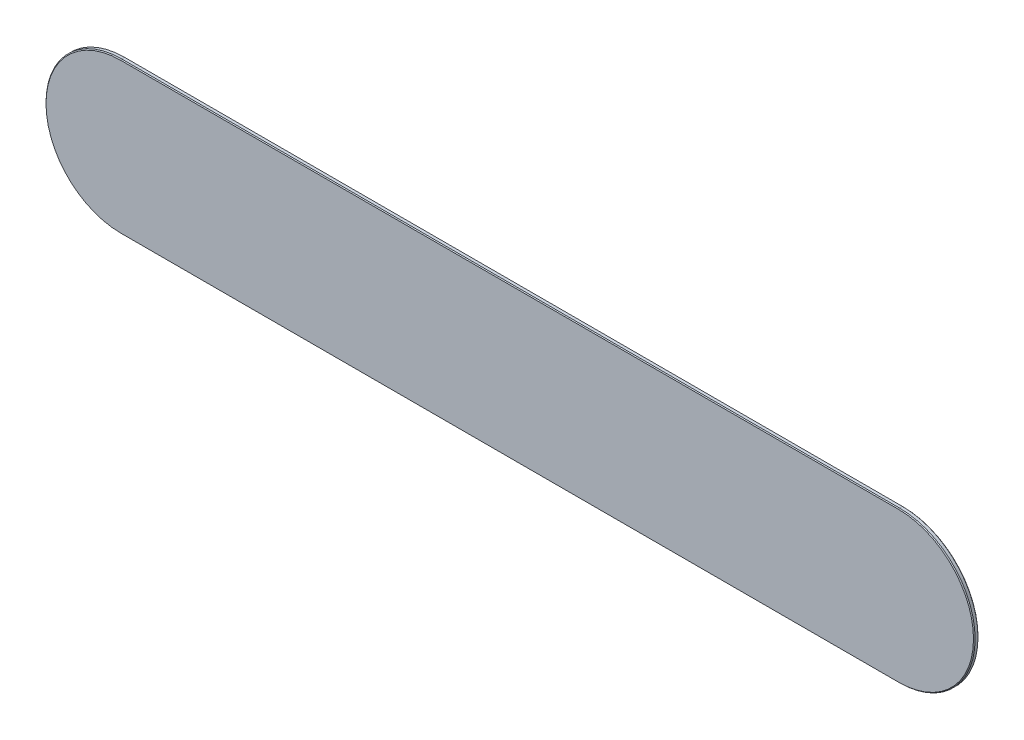
ISO-10303-21;
HEADER;
FILE_DESCRIPTION(('STEP AP214'),'2;1');
FILE_NAME('part.step','',(''),(''),'','','');
FILE_SCHEMA(('AUTOMOTIVE_DESIGN { 1 0 10303 214 1 1 1 1 }'));
ENDSEC;
DATA;
#1=APPLICATION_CONTEXT('core data for automotive mechanical design processes');
#2=APPLICATION_PROTOCOL_DEFINITION('international standard','automotive_design',2000,#1);
#3=PRODUCT_CONTEXT('',#1,'mechanical');
#4=PRODUCT('Part','Part','',(#3));
#5=PRODUCT_RELATED_PRODUCT_CATEGORY('part','',(#4));
#6=PRODUCT_DEFINITION_FORMATION('','',#4);
#7=PRODUCT_DEFINITION_CONTEXT('part definition',#1,'design');
#8=PRODUCT_DEFINITION('design','',#6,#7);
#9=PRODUCT_DEFINITION_SHAPE('','',#8);
#10=(LENGTH_UNIT() NAMED_UNIT(*) SI_UNIT(.MILLI.,.METRE.));
#11=(NAMED_UNIT(*) PLANE_ANGLE_UNIT() SI_UNIT($,.RADIAN.));
#12=(NAMED_UNIT(*) SI_UNIT($,.STERADIAN.) SOLID_ANGLE_UNIT());
#13=UNCERTAINTY_MEASURE_WITH_UNIT(LENGTH_MEASURE(1.E-05),#10,'distance_accuracy_value','');
#14=(GEOMETRIC_REPRESENTATION_CONTEXT(3) GLOBAL_UNCERTAINTY_ASSIGNED_CONTEXT((#13)) GLOBAL_UNIT_ASSIGNED_CONTEXT((#10,
#11,#12)) REPRESENTATION_CONTEXT('',''));
#15=CARTESIAN_POINT('',(0.,0.,0.));
#16=DIRECTION('',(0.,0.,1.));
#17=DIRECTION('',(1.,0.,0.));
#18=AXIS2_PLACEMENT_3D('',#15,#16,#17);
#19=CARTESIAN_POINT('',(0.,-9.19,-0.6));
#20=DIRECTION('',(0.,-0.707106781186548,-0.707106781186548));
#21=DIRECTION('',(0.,-0.707106781186548,0.707106781186548));
#22=AXIS2_PLACEMENT_3D('',#19,#20,#21);
#23=PLANE('',#22);
#24=DIRECTION('',(-2.45688067934799E-11,-0.707106781186498,0.707106781186598));
#25=VECTOR('',#24,1.);
#26=CARTESIAN_POINT('',(47.5,-9.14,-0.65));
#27=LINE('',#26,#25);
#28=CARTESIAN_POINT('',(47.5,-9.14,-0.65));
#29=VERTEX_POINT('',#28);
#30=CARTESIAN_POINT('',(47.49999999999,-9.24,-0.55));
#31=VERTEX_POINT('',#30);
#32=EDGE_CURVE('E128',#29,#31,#27,.T.);
#33=ORIENTED_EDGE('',*,*,#32,.T.);
#34=DIRECTION('',(1.,0.,0.));
#35=VECTOR('',#34,1.);
#36=CARTESIAN_POINT('',(-47.49999999999,-9.24,-0.55));
#37=LINE('',#36,#35);
#38=CARTESIAN_POINT('',(-47.49999999999,-9.24,-0.55));
#39=VERTEX_POINT('',#38);
#40=EDGE_CURVE('E125',#39,#31,#37,.T.);
#41=ORIENTED_EDGE('',*,*,#40,.F.);
#42=DIRECTION('',(-2.49205075042299E-11,0.707106781186498,-0.707106781186598));
#43=VECTOR('',#42,1.);
#44=CARTESIAN_POINT('',(-47.49999999999,-9.24,-0.55));
#45=LINE('',#44,#43);
#46=CARTESIAN_POINT('',(-47.5,-9.14,-0.65));
#47=VERTEX_POINT('',#46);
#48=EDGE_CURVE('E11',#39,#47,#45,.T.);
#49=ORIENTED_EDGE('',*,*,#48,.T.);
#50=DIRECTION('',(1.,0.,0.));
#51=VECTOR('',#50,1.);
#52=CARTESIAN_POINT('',(-47.5,-9.14,-0.65));
#53=LINE('',#52,#51);
#54=EDGE_CURVE('E174',#47,#29,#53,.T.);
#55=ORIENTED_EDGE('',*,*,#54,.T.);
#56=EDGE_LOOP('',(#33,#41,#49,#55));
#57=FACE_BOUND('',#56,.T.);
#58=ADVANCED_FACE('F17',(#57),#23,.T.);
#59=CARTESIAN_POINT('',(-47.5,0.,-0.6));
#60=DIRECTION('',(0.,0.,1.));
#61=DIRECTION('',(0.,-1.,0.));
#62=AXIS2_PLACEMENT_3D('',#59,#60,#61);
#63=CONICAL_SURFACE('',#62,9.19,0.7853981633973);
#64=ORIENTED_EDGE('',*,*,#48,.F.);
#65=CARTESIAN_POINT('',(-47.5,0.,-0.55));
#66=DIRECTION('',(0.,0.,1.));
#67=DIRECTION('',(-1.,0.,0.));
#68=AXIS2_PLACEMENT_3D('',#65,#66,#67);
#69=CIRCLE('',#68,9.24);
#70=CARTESIAN_POINT('',(-56.74,0.,-0.55));
#71=VERTEX_POINT('',#70);
#72=EDGE_CURVE('E114',#71,#39,#69,.T.);
#73=ORIENTED_EDGE('',*,*,#72,.F.);
#74=CARTESIAN_POINT('',(-47.5,0.,-0.55));
#75=DIRECTION('',(0.,0.,1.));
#76=DIRECTION('',(1.08196280218E-12,1.,0.));
#77=AXIS2_PLACEMENT_3D('',#74,#75,#76);
#78=CIRCLE('',#77,9.24);
#79=CARTESIAN_POINT('',(-47.49999999999,9.24,-0.55));
#80=VERTEX_POINT('',#79);
#81=EDGE_CURVE('E144',#80,#71,#78,.T.);
#82=ORIENTED_EDGE('',*,*,#81,.F.);
#83=DIRECTION('',(1.778600737197E-11,0.707106781186598,0.707106781186498));
#84=VECTOR('',#83,1.);
#85=CARTESIAN_POINT('',(-47.49999999999,9.14,-0.65));
#86=LINE('',#85,#84);
#87=CARTESIAN_POINT('',(-47.49999999999,9.14,-0.65));
#88=VERTEX_POINT('',#87);
#89=EDGE_CURVE('E28',#88,#80,#86,.T.);
#90=ORIENTED_EDGE('',*,*,#89,.F.);
#91=CARTESIAN_POINT('',(-47.5,0.,-0.65));
#92=DIRECTION('',(0.,0.,1.));
#93=DIRECTION('',(0.,1.,0.));
#94=AXIS2_PLACEMENT_3D('',#91,#92,#93);
#95=CIRCLE('',#94,9.14);
#96=EDGE_CURVE('E121',#88,#47,#95,.T.);
#97=ORIENTED_EDGE('',*,*,#96,.T.);
#98=EDGE_LOOP('',(#64,#73,#82,#90,#97));
#99=FACE_BOUND('',#98,.T.);
#100=ADVANCED_FACE('F119',(#99),#63,.T.);
#101=CARTESIAN_POINT('',(0.,9.19,-0.6));
#102=DIRECTION('',(0.,0.707106781186598,-0.707106781186498));
#103=DIRECTION('',(-1.,0.,0.));
#104=AXIS2_PLACEMENT_3D('',#101,#102,#103);
#105=PLANE('',#104);
#106=ORIENTED_EDGE('',*,*,#89,.T.);
#107=DIRECTION('',(-1.,0.,0.));
#108=VECTOR('',#107,1.);
#109=CARTESIAN_POINT('',(47.49999999999,9.24,-0.55));
#110=LINE('',#109,#108);
#111=CARTESIAN_POINT('',(47.49999999999,9.24,-0.55));
#112=VERTEX_POINT('',#111);
#113=EDGE_CURVE('E157',#112,#80,#110,.T.);
#114=ORIENTED_EDGE('',*,*,#113,.F.);
#115=DIRECTION('',(1.84391658347799E-11,-0.707106781186498,-0.707106781186598));
#116=VECTOR('',#115,1.);
#117=CARTESIAN_POINT('',(47.49999999999,9.24,-0.55));
#118=LINE('',#117,#116);
#119=CARTESIAN_POINT('',(47.5,9.14,-0.65));
#120=VERTEX_POINT('',#119);
#121=EDGE_CURVE('E175',#112,#120,#118,.T.);
#122=ORIENTED_EDGE('',*,*,#121,.T.);
#123=DIRECTION('',(-1.,0.,0.));
#124=VECTOR('',#123,1.);
#125=CARTESIAN_POINT('',(47.49999999999,9.14,-0.65));
#126=LINE('',#125,#124);
#127=EDGE_CURVE('E186',#120,#88,#126,.T.);
#128=ORIENTED_EDGE('',*,*,#127,.T.);
#129=EDGE_LOOP('',(#106,#114,#122,#128));
#130=FACE_BOUND('',#129,.T.);
#131=ADVANCED_FACE('F241',(#130),#105,.T.);
#132=CARTESIAN_POINT('',(0.,0.,-0.65));
#133=DIRECTION('',(0.,0.,1.));
#134=DIRECTION('',(1.,0.,0.));
#135=AXIS2_PLACEMENT_3D('',#132,#133,#134);
#136=PLANE('',#135);
#137=ORIENTED_EDGE('',*,*,#54,.F.);
#138=ORIENTED_EDGE('',*,*,#96,.F.);
#139=ORIENTED_EDGE('',*,*,#127,.F.);
#140=CARTESIAN_POINT('',(47.5,0.,-0.65));
#141=DIRECTION('',(0.,0.,1.));
#142=DIRECTION('',(0.,-1.,0.));
#143=AXIS2_PLACEMENT_3D('',#140,#141,#142);
#144=CIRCLE('',#143,9.14);
#145=EDGE_CURVE('E170',#29,#120,#144,.T.);
#146=ORIENTED_EDGE('',*,*,#145,.F.);
#147=EDGE_LOOP('',(#137,#138,#139,#146));
#148=FACE_BOUND('',#147,.T.);
#149=ADVANCED_FACE('F19',(#148),#136,.F.);
#150=CARTESIAN_POINT('',(47.5,0.,-0.6));
#151=DIRECTION('',(0.,0.,1.));
#152=DIRECTION('',(0.,-1.,0.));
#153=AXIS2_PLACEMENT_3D('',#150,#151,#152);
#154=CONICAL_SURFACE('',#153,9.19,0.7853981633973);
#155=ORIENTED_EDGE('',*,*,#121,.F.);
#156=CARTESIAN_POINT('',(47.5,0.,-0.55));
#157=DIRECTION('',(0.,0.,1.));
#158=DIRECTION('',(1.,0.,0.));
#159=AXIS2_PLACEMENT_3D('',#156,#157,#158);
#160=CIRCLE('',#159,9.24);
#161=CARTESIAN_POINT('',(56.74,0.,-0.55));
#162=VERTEX_POINT('',#161);
#163=EDGE_CURVE('E179',#162,#112,#160,.T.);
#164=ORIENTED_EDGE('',*,*,#163,.F.);
#165=CARTESIAN_POINT('',(47.5,0.,-0.55));
#166=DIRECTION('',(0.,0.,1.));
#167=DIRECTION('',(-1.08196280218E-12,-1.,0.));
#168=AXIS2_PLACEMENT_3D('',#165,#166,#167);
#169=CIRCLE('',#168,9.24);
#170=EDGE_CURVE('E223',#31,#162,#169,.T.);
#171=ORIENTED_EDGE('',*,*,#170,.F.);
#172=ORIENTED_EDGE('',*,*,#32,.F.);
#173=ORIENTED_EDGE('',*,*,#145,.T.);
#174=EDGE_LOOP('',(#155,#164,#171,#172,#173));
#175=FACE_BOUND('',#174,.T.);
#176=ADVANCED_FACE('F300',(#175),#154,.T.);
#177=CARTESIAN_POINT('',(47.5,0.,-0.1));
#178=DIRECTION('',(0.,0.,1.));
#179=DIRECTION('',(1.,0.,0.));
#180=AXIS2_PLACEMENT_3D('',#177,#178,#179);
#181=CYLINDRICAL_SURFACE('',#180,9.24);
#182=DIRECTION('',(0.,0.,1.));
#183=VECTOR('',#182,1.);
#184=CARTESIAN_POINT('',(47.49999999999,-9.24,-0.55));
#185=LINE('',#184,#183);
#186=CARTESIAN_POINT('',(47.49999999999,-9.24,-0.2));
#187=VERTEX_POINT('',#186);
#188=EDGE_CURVE('E132',#31,#187,#185,.T.);
#189=ORIENTED_EDGE('',*,*,#188,.F.);
#190=ORIENTED_EDGE('',*,*,#170,.T.);
#191=ORIENTED_EDGE('',*,*,#163,.T.);
#192=DIRECTION('',(0.,0.,-1.));
#193=VECTOR('',#192,1.);
#194=CARTESIAN_POINT('',(47.49999999999,9.24,-0.2));
#195=LINE('',#194,#193);
#196=CARTESIAN_POINT('',(47.49999999999,9.24,-0.2));
#197=VERTEX_POINT('',#196);
#198=EDGE_CURVE('E184',#197,#112,#195,.T.);
#199=ORIENTED_EDGE('',*,*,#198,.F.);
#200=CARTESIAN_POINT('',(47.5,0.,-0.2));
#201=DIRECTION('',(0.,0.,-1.));
#202=DIRECTION('',(-1.08196280218E-12,1.,0.));
#203=AXIS2_PLACEMENT_3D('',#200,#201,#202);
#204=CIRCLE('',#203,9.24);
#205=CARTESIAN_POINT('',(56.74,0.,-0.2));
#206=VERTEX_POINT('',#205);
#207=EDGE_CURVE('E197',#197,#206,#204,.T.);
#208=ORIENTED_EDGE('',*,*,#207,.T.);
#209=CARTESIAN_POINT('',(47.5,0.,-0.2));
#210=DIRECTION('',(0.,0.,-1.));
#211=DIRECTION('',(1.,0.,0.));
#212=AXIS2_PLACEMENT_3D('',#209,#210,#211);
#213=CIRCLE('',#212,9.24);
#214=EDGE_CURVE('E200',#206,#187,#213,.T.);
#215=ORIENTED_EDGE('',*,*,#214,.T.);
#216=EDGE_LOOP('',(#189,#190,#191,#199,#208,#215));
#217=FACE_BOUND('',#216,.T.);
#218=ADVANCED_FACE('F238',(#217),#181,.T.);
#219=CARTESIAN_POINT('',(-47.5,-9.24,-0.1));
#220=DIRECTION('',(0.,-1.,0.));
#221=DIRECTION('',(0.,0.,-1.));
#222=AXIS2_PLACEMENT_3D('',#219,#220,#221);
#223=PLANE('',#222);
#224=DIRECTION('',(0.,0.,-1.));
#225=VECTOR('',#224,1.);
#226=CARTESIAN_POINT('',(-47.49999999999,-9.24,-0.2));
#227=LINE('',#226,#225);
#228=CARTESIAN_POINT('',(-47.49999999999,-9.24,-0.2));
#229=VERTEX_POINT('',#228);
#230=EDGE_CURVE('E133',#229,#39,#227,.T.);
#231=ORIENTED_EDGE('',*,*,#230,.T.);
#232=ORIENTED_EDGE('',*,*,#40,.T.);
#233=ORIENTED_EDGE('',*,*,#188,.T.);
#234=DIRECTION('',(-1.,0.,0.));
#235=VECTOR('',#234,1.);
#236=CARTESIAN_POINT('',(47.49999999999,-9.24,-0.2));
#237=LINE('',#236,#235);
#238=EDGE_CURVE('E138',#187,#229,#237,.T.);
#239=ORIENTED_EDGE('',*,*,#238,.T.);
#240=EDGE_LOOP('',(#231,#232,#233,#239));
#241=FACE_BOUND('',#240,.T.);
#242=ADVANCED_FACE('F136',(#241),#223,.T.);
#243=CARTESIAN_POINT('',(-47.5,0.,-0.1));
#244=DIRECTION('',(0.,0.,1.));
#245=DIRECTION('',(1.,0.,0.));
#246=AXIS2_PLACEMENT_3D('',#243,#244,#245);
#247=CYLINDRICAL_SURFACE('',#246,9.24);
#248=DIRECTION('',(0.,0.,1.));
#249=VECTOR('',#248,1.);
#250=CARTESIAN_POINT('',(-47.49999999999,9.24,-0.55));
#251=LINE('',#250,#249);
#252=CARTESIAN_POINT('',(-47.49999999999,9.24,-0.2));
#253=VERTEX_POINT('',#252);
#254=EDGE_CURVE('E151',#80,#253,#251,.T.);
#255=ORIENTED_EDGE('',*,*,#254,.F.);
#256=ORIENTED_EDGE('',*,*,#81,.T.);
#257=ORIENTED_EDGE('',*,*,#72,.T.);
#258=ORIENTED_EDGE('',*,*,#230,.F.);
#259=CARTESIAN_POINT('',(-47.5,0.,-0.2));
#260=DIRECTION('',(0.,0.,-1.));
#261=DIRECTION('',(1.080424830891E-12,-1.,0.));
#262=AXIS2_PLACEMENT_3D('',#259,#260,#261);
#263=CIRCLE('',#262,9.24);
#264=CARTESIAN_POINT('',(-56.74,0.,-0.2));
#265=VERTEX_POINT('',#264);
#266=EDGE_CURVE('E169',#229,#265,#263,.T.);
#267=ORIENTED_EDGE('',*,*,#266,.T.);
#268=CARTESIAN_POINT('',(-47.5,0.,-0.2));
#269=DIRECTION('',(0.,0.,-1.));
#270=DIRECTION('',(-1.,0.,0.));
#271=AXIS2_PLACEMENT_3D('',#268,#269,#270);
#272=CIRCLE('',#271,9.24);
#273=EDGE_CURVE('E161',#265,#253,#272,.T.);
#274=ORIENTED_EDGE('',*,*,#273,.T.);
#275=EDGE_LOOP('',(#255,#256,#257,#258,#267,#274));
#276=FACE_BOUND('',#275,.T.);
#277=ADVANCED_FACE('F143',(#276),#247,.T.);
#278=CARTESIAN_POINT('',(47.5,9.24,-0.1));
#279=DIRECTION('',(0.,1.,0.));
#280=DIRECTION('',(1.,0.,0.));
#281=AXIS2_PLACEMENT_3D('',#278,#279,#280);
#282=PLANE('',#281);
#283=ORIENTED_EDGE('',*,*,#198,.T.);
#284=ORIENTED_EDGE('',*,*,#113,.T.);
#285=ORIENTED_EDGE('',*,*,#254,.T.);
#286=DIRECTION('',(1.,0.,0.));
#287=VECTOR('',#286,1.);
#288=CARTESIAN_POINT('',(-47.49999999999,9.24,-0.2));
#289=LINE('',#288,#287);
#290=EDGE_CURVE('E180',#253,#197,#289,.T.);
#291=ORIENTED_EDGE('',*,*,#290,.T.);
#292=EDGE_LOOP('',(#283,#284,#285,#291));
#293=FACE_BOUND('',#292,.T.);
#294=ADVANCED_FACE('F243',(#293),#282,.T.);
#295=CARTESIAN_POINT('',(0.,9.19,-0.15));
#296=DIRECTION('',(0.,0.707106781186598,0.707106781186498));
#297=DIRECTION('',(1.,0.,0.));
#298=AXIS2_PLACEMENT_3D('',#295,#296,#297);
#299=PLANE('',#298);
#300=DIRECTION('',(-1.84391658347799E-11,0.707106781186498,-0.707106781186598));
#301=VECTOR('',#300,1.);
#302=CARTESIAN_POINT('',(47.49999999999,9.14,-0.1));
#303=LINE('',#302,#301);
#304=CARTESIAN_POINT('',(47.49999999999,9.14,-0.1));
#305=VERTEX_POINT('',#304);
#306=EDGE_CURVE('E185',#305,#197,#303,.T.);
#307=ORIENTED_EDGE('',*,*,#306,.T.);
#308=ORIENTED_EDGE('',*,*,#290,.F.);
#309=DIRECTION('',(-1.778600737197E-11,-0.707106781186598,0.707106781186498));
#310=VECTOR('',#309,1.);
#311=CARTESIAN_POINT('',(-47.49999999999,9.24,-0.2));
#312=LINE('',#311,#310);
#313=CARTESIAN_POINT('',(-47.5,9.14,-0.09999999999999));
#314=VERTEX_POINT('',#313);
#315=EDGE_CURVE('E158',#253,#314,#312,.T.);
#316=ORIENTED_EDGE('',*,*,#315,.T.);
#317=DIRECTION('',(1.,0.,0.));
#318=VECTOR('',#317,1.);
#319=CARTESIAN_POINT('',(-47.49999999999,9.14,-0.09999999999999));
#320=LINE('',#319,#318);
#321=EDGE_CURVE('E208',#314,#305,#320,.T.);
#322=ORIENTED_EDGE('',*,*,#321,.T.);
#323=EDGE_LOOP('',(#307,#308,#316,#322));
#324=FACE_BOUND('',#323,.T.);
#325=ADVANCED_FACE('F248',(#324),#299,.T.);
#326=CARTESIAN_POINT('',(47.5,0.,-0.15));
#327=DIRECTION('',(0.,0.,-1.));
#328=DIRECTION('',(0.,-1.,0.));
#329=AXIS2_PLACEMENT_3D('',#326,#327,#328);
#330=CONICAL_SURFACE('',#329,9.19,0.7853981633973);
#331=DIRECTION('',(2.45688067934799E-11,0.707106781186598,0.707106781186498));
#332=VECTOR('',#331,1.);
#333=CARTESIAN_POINT('',(47.49999999999,-9.24,-0.2));
#334=LINE('',#333,#332);
#335=CARTESIAN_POINT('',(47.5,-9.14,-0.1));
#336=VERTEX_POINT('',#335);
#337=EDGE_CURVE('E165',#187,#336,#334,.T.);
#338=ORIENTED_EDGE('',*,*,#337,.F.);
#339=ORIENTED_EDGE('',*,*,#214,.F.);
#340=ORIENTED_EDGE('',*,*,#207,.F.);
#341=ORIENTED_EDGE('',*,*,#306,.F.);
#342=CARTESIAN_POINT('',(47.5,0.,-0.1));
#343=DIRECTION('',(0.,0.,-1.));
#344=DIRECTION('',(0.,1.,0.));
#345=AXIS2_PLACEMENT_3D('',#342,#343,#344);
#346=CIRCLE('',#345,9.14);
#347=EDGE_CURVE('E211',#305,#336,#346,.T.);
#348=ORIENTED_EDGE('',*,*,#347,.T.);
#349=EDGE_LOOP('',(#338,#339,#340,#341,#348));
#350=FACE_BOUND('',#349,.T.);
#351=ADVANCED_FACE('F254',(#350),#330,.T.);
#352=CARTESIAN_POINT('',(0.,-9.19,-0.15));
#353=DIRECTION('',(0.,-0.707106781186548,0.707106781186548));
#354=DIRECTION('',(-1.,0.,0.));
#355=AXIS2_PLACEMENT_3D('',#352,#353,#354);
#356=PLANE('',#355);
#357=DIRECTION('',(2.49707504629099E-11,-0.707106781186498,-0.707106781186598));
#358=VECTOR('',#357,1.);
#359=CARTESIAN_POINT('',(-47.5,-9.14,-0.09999999999999));
#360=LINE('',#359,#358);
#361=CARTESIAN_POINT('',(-47.5,-9.14,-0.09999999999999));
#362=VERTEX_POINT('',#361);
#363=EDGE_CURVE('E166',#362,#229,#360,.T.);
#364=ORIENTED_EDGE('',*,*,#363,.T.);
#365=ORIENTED_EDGE('',*,*,#238,.F.);
#366=ORIENTED_EDGE('',*,*,#337,.T.);
#367=DIRECTION('',(-1.,0.,0.));
#368=VECTOR('',#367,1.);
#369=CARTESIAN_POINT('',(47.5,-9.14,-0.1));
#370=LINE('',#369,#368);
#371=EDGE_CURVE('E21',#336,#362,#370,.T.);
#372=ORIENTED_EDGE('',*,*,#371,.T.);
#373=EDGE_LOOP('',(#364,#365,#366,#372));
#374=FACE_BOUND('',#373,.T.);
#375=ADVANCED_FACE('F258',(#374),#356,.T.);
#376=CARTESIAN_POINT('',(-47.5,0.,-0.15));
#377=DIRECTION('',(0.,0.,-1.));
#378=DIRECTION('',(0.,-1.,0.));
#379=AXIS2_PLACEMENT_3D('',#376,#377,#378);
#380=CONICAL_SURFACE('',#379,9.19,0.7853981633973);
#381=ORIENTED_EDGE('',*,*,#315,.F.);
#382=ORIENTED_EDGE('',*,*,#273,.F.);
#383=ORIENTED_EDGE('',*,*,#266,.F.);
#384=ORIENTED_EDGE('',*,*,#363,.F.);
#385=CARTESIAN_POINT('',(-47.5,0.,-0.09999999999999));
#386=DIRECTION('',(0.,0.,-1.));
#387=DIRECTION('',(0.,-1.,0.));
#388=AXIS2_PLACEMENT_3D('',#385,#386,#387);
#389=CIRCLE('',#388,9.14);
#390=EDGE_CURVE('E162',#362,#314,#389,.T.);
#391=ORIENTED_EDGE('',*,*,#390,.T.);
#392=EDGE_LOOP('',(#381,#382,#383,#384,#391));
#393=FACE_BOUND('',#392,.T.);
#394=ADVANCED_FACE('F264',(#393),#380,.T.);
#395=CARTESIAN_POINT('',(0.,0.,-0.1));
#396=DIRECTION('',(0.,0.,1.));
#397=DIRECTION('',(1.,0.,0.));
#398=AXIS2_PLACEMENT_3D('',#395,#396,#397);
#399=PLANE('',#398);
#400=ORIENTED_EDGE('',*,*,#371,.F.);
#401=ORIENTED_EDGE('',*,*,#347,.F.);
#402=ORIENTED_EDGE('',*,*,#321,.F.);
#403=ORIENTED_EDGE('',*,*,#390,.F.);
#404=EDGE_LOOP('',(#400,#401,#402,#403));
#405=FACE_BOUND('',#404,.T.);
#406=ADVANCED_FACE('F267',(#405),#399,.T.);
#407=CLOSED_SHELL('',(#58,#100,#131,#149,#176,#218,#242,#277,#294,#325,#351,#375,#394,#406));
#408=MANIFOLD_SOLID_BREP('B1',#407);
#409=ADVANCED_BREP_SHAPE_REPRESENTATION('',(#18,#408),#14);
#410=SHAPE_DEFINITION_REPRESENTATION(#9,#409);
ENDSEC;
END-ISO-10303-21;
